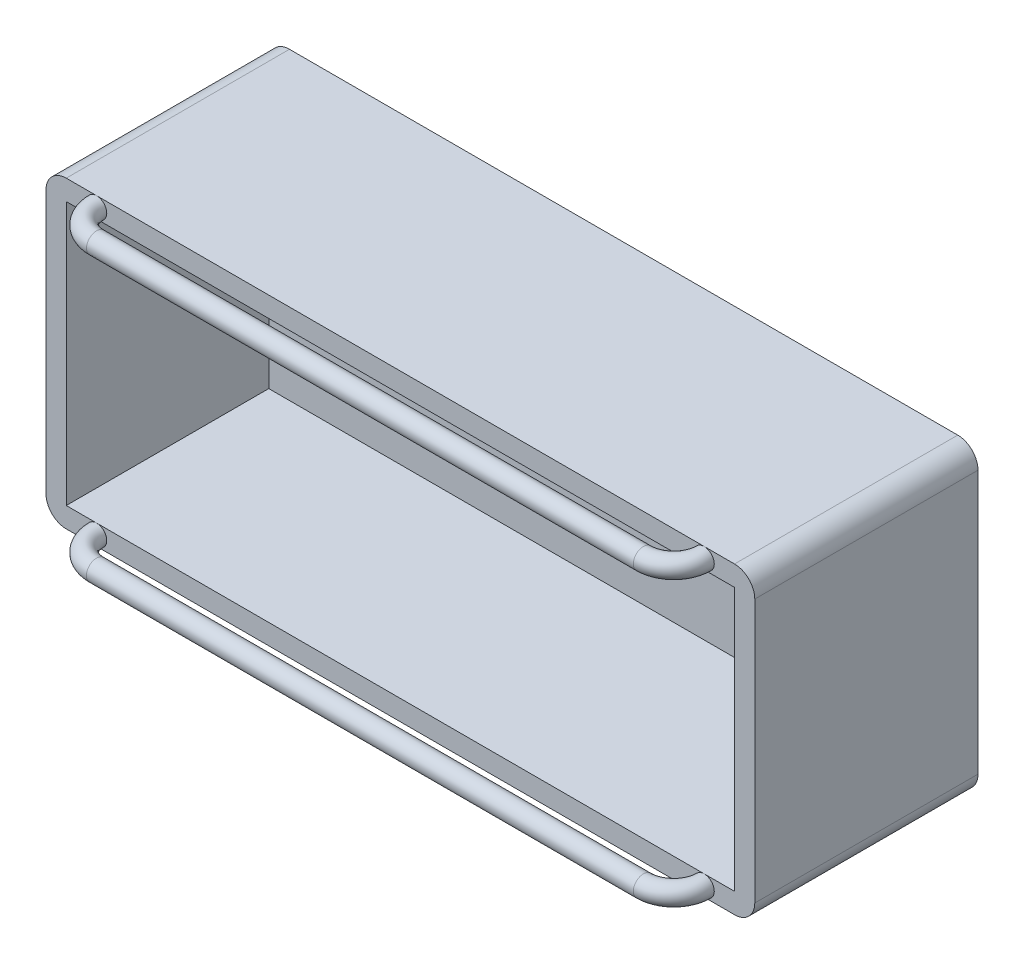
ISO-10303-21;
HEADER;
FILE_DESCRIPTION(('STEP AP214'),'2;1');
FILE_NAME('part.step','',(''),(''),'','','');
FILE_SCHEMA(('AUTOMOTIVE_DESIGN { 1 0 10303 214 1 1 1 1 }'));
ENDSEC;
DATA;
#1=APPLICATION_CONTEXT('core data for automotive mechanical design processes');
#2=APPLICATION_PROTOCOL_DEFINITION('international standard','automotive_design',2000,#1);
#3=PRODUCT_CONTEXT('',#1,'mechanical');
#4=PRODUCT('Part','Part','',(#3));
#5=PRODUCT_RELATED_PRODUCT_CATEGORY('part','',(#4));
#6=PRODUCT_DEFINITION_FORMATION('','',#4);
#7=PRODUCT_DEFINITION_CONTEXT('part definition',#1,'design');
#8=PRODUCT_DEFINITION('design','',#6,#7);
#9=PRODUCT_DEFINITION_SHAPE('','',#8);
#10=(LENGTH_UNIT() NAMED_UNIT(*) SI_UNIT(.MILLI.,.METRE.));
#11=(NAMED_UNIT(*) PLANE_ANGLE_UNIT() SI_UNIT($,.RADIAN.));
#12=(NAMED_UNIT(*) SI_UNIT($,.STERADIAN.) SOLID_ANGLE_UNIT());
#13=UNCERTAINTY_MEASURE_WITH_UNIT(LENGTH_MEASURE(1.E-05),#10,'distance_accuracy_value','');
#14=(GEOMETRIC_REPRESENTATION_CONTEXT(3) GLOBAL_UNCERTAINTY_ASSIGNED_CONTEXT((#13)) GLOBAL_UNIT_ASSIGNED_CONTEXT((#10,
#11,#12)) REPRESENTATION_CONTEXT('',''));
#15=CARTESIAN_POINT('',(0.,0.,0.));
#16=DIRECTION('',(0.,0.,1.));
#17=DIRECTION('',(1.,0.,0.));
#18=AXIS2_PLACEMENT_3D('',#15,#16,#17);
#19=CARTESIAN_POINT('',(0.,0.,22.0456351873431));
#20=DIRECTION('',(0.,0.,-1.));
#21=DIRECTION('',(-1.,0.,0.));
#22=AXIS2_PLACEMENT_3D('',#19,#20,#21);
#23=PLANE('',#22);
#24=CARTESIAN_POINT('',(5.,29.,22.0456351873431));
#25=DIRECTION('',(-2.60208521398066E-12,0.,1.));
#26=DIRECTION('',(1.,0.,2.60208521398066E-12));
#27=AXIS2_PLACEMENT_3D('',#24,#25,#26);
#28=CIRCLE('',#27,1.);
#29=CARTESIAN_POINT('',(5.,30.,22.0456351873431));
#30=VERTEX_POINT('',#29);
#31=CARTESIAN_POINT('',(5.,28.,22.0456351873431));
#32=VERTEX_POINT('',#31);
#33=EDGE_CURVE('E409',#30,#32,#28,.T.);
#34=ORIENTED_EDGE('',*,*,#33,.F.);
#35=DIRECTION('',(-1.,0.,0.));
#36=VECTOR('',#35,1.);
#37=CARTESIAN_POINT('',(0.,30.,22.0456351873431));
#38=LINE('',#37,#36);
#39=CARTESIAN_POINT('',(2.,30.,22.0456351873431));
#40=VERTEX_POINT('',#39);
#41=EDGE_CURVE('E483',#30,#40,#38,.T.);
#42=ORIENTED_EDGE('',*,*,#41,.T.);
#43=CARTESIAN_POINT('',(2.,28.,22.0456351873431));
#44=DIRECTION('',(0.,0.,-1.));
#45=DIRECTION('',(-1.,0.,0.));
#46=AXIS2_PLACEMENT_3D('',#43,#44,#45);
#47=CIRCLE('',#46,2.);
#48=CARTESIAN_POINT('',(0.,28.,22.0456351873431));
#49=VERTEX_POINT('',#48);
#50=EDGE_CURVE('E553',#40,#49,#47,.F.);
#51=ORIENTED_EDGE('',*,*,#50,.T.);
#52=DIRECTION('',(0.,-1.,0.));
#53=VECTOR('',#52,1.);
#54=CARTESIAN_POINT('',(0.,0.,22.0456351873431));
#55=LINE('',#54,#53);
#56=CARTESIAN_POINT('',(0.,2.,22.0456351873431));
#57=VERTEX_POINT('',#56);
#58=EDGE_CURVE('E470',#49,#57,#55,.T.);
#59=ORIENTED_EDGE('',*,*,#58,.T.);
#60=CARTESIAN_POINT('',(2.,2.,22.0456351873431));
#61=DIRECTION('',(0.,0.,-1.));
#62=DIRECTION('',(-1.,0.,0.));
#63=AXIS2_PLACEMENT_3D('',#60,#61,#62);
#64=CIRCLE('',#63,2.);
#65=CARTESIAN_POINT('',(2.,0.,22.0456351873431));
#66=VERTEX_POINT('',#65);
#67=EDGE_CURVE('E539',#57,#66,#64,.F.);
#68=ORIENTED_EDGE('',*,*,#67,.T.);
#69=DIRECTION('',(1.,0.,0.));
#70=VECTOR('',#69,1.);
#71=CARTESIAN_POINT('',(0.,0.,22.0456351873431));
#72=LINE('',#71,#70);
#73=CARTESIAN_POINT('',(5.,0.,22.0456351873431));
#74=VERTEX_POINT('',#73);
#75=EDGE_CURVE('E472',#66,#74,#72,.T.);
#76=ORIENTED_EDGE('',*,*,#75,.T.);
#77=CARTESIAN_POINT('',(5.,0.999999999999999,22.0456351873431));
#78=DIRECTION('',(0.,0.,-1.));
#79=DIRECTION('',(-1.,0.,0.));
#80=AXIS2_PLACEMENT_3D('',#77,#78,#79);
#81=CIRCLE('',#80,1.);
#82=CARTESIAN_POINT('',(5.,2.,22.0456351873431));
#83=VERTEX_POINT('',#82);
#84=EDGE_CURVE('E73',#74,#83,#81,.T.);
#85=ORIENTED_EDGE('',*,*,#84,.T.);
#86=DIRECTION('',(1.,0.,0.));
#87=VECTOR('',#86,1.);
#88=CARTESIAN_POINT('',(2.,2.,22.0456351873431));
#89=LINE('',#88,#87);
#90=CARTESIAN_POINT('',(2.,2.,22.0456351873431));
#91=VERTEX_POINT('',#90);
#92=EDGE_CURVE('E288',#91,#83,#89,.T.);
#93=ORIENTED_EDGE('',*,*,#92,.F.);
#94=DIRECTION('',(0.,-1.,0.));
#95=VECTOR('',#94,1.);
#96=CARTESIAN_POINT('',(2.,28.,22.0456351873431));
#97=LINE('',#96,#95);
#98=CARTESIAN_POINT('',(2.,28.,22.0456351873431));
#99=VERTEX_POINT('',#98);
#100=EDGE_CURVE('E256',#99,#91,#97,.T.);
#101=ORIENTED_EDGE('',*,*,#100,.F.);
#102=DIRECTION('',(-1.,0.,0.));
#103=VECTOR('',#102,1.);
#104=CARTESIAN_POINT('',(2.,28.,22.0456351873431));
#105=LINE('',#104,#103);
#106=EDGE_CURVE('E249',#32,#99,#105,.T.);
#107=ORIENTED_EDGE('',*,*,#106,.F.);
#108=EDGE_LOOP('',(#34,#42,#51,#59,#68,#76,#85,#93,#101,#107));
#109=FACE_BOUND('',#108,.T.);
#110=ADVANCED_FACE('F63',(#109),#23,.F.);
#111=EDGE_CURVE('E89',#32,#30,#28,.T.);
#112=ORIENTED_EDGE('',*,*,#111,.F.);
#113=CARTESIAN_POINT('',(65.,28.,22.0456351873431));
#114=VERTEX_POINT('',#113);
#115=EDGE_CURVE('E244',#114,#32,#105,.T.);
#116=ORIENTED_EDGE('',*,*,#115,.F.);
#117=CARTESIAN_POINT('',(65.,29.,22.0456351873431));
#118=DIRECTION('',(1.73472347599012E-12,0.,-1.));
#119=DIRECTION('',(-1.,0.,-1.73472347599012E-12));
#120=AXIS2_PLACEMENT_3D('',#117,#118,#119);
#121=CIRCLE('',#120,1.);
#122=CARTESIAN_POINT('',(65.,30.,22.0456351873431));
#123=VERTEX_POINT('',#122);
#124=EDGE_CURVE('E226',#114,#123,#121,.T.);
#125=ORIENTED_EDGE('',*,*,#124,.T.);
#126=EDGE_CURVE('E486',#123,#30,#38,.T.);
#127=ORIENTED_EDGE('',*,*,#126,.T.);
#128=EDGE_LOOP('',(#112,#116,#125,#127));
#129=FACE_BOUND('',#128,.T.);
#130=ADVANCED_FACE('F245',(#129),#23,.F.);
#131=CARTESIAN_POINT('',(68.,30.,22.0456351873431));
#132=VERTEX_POINT('',#131);
#133=EDGE_CURVE('E241',#132,#123,#38,.T.);
#134=ORIENTED_EDGE('',*,*,#133,.T.);
#135=EDGE_CURVE('E81',#123,#114,#121,.T.);
#136=ORIENTED_EDGE('',*,*,#135,.T.);
#137=CARTESIAN_POINT('',(68.,28.,22.0456351873431));
#138=VERTEX_POINT('',#137);
#139=EDGE_CURVE('E239',#138,#114,#105,.T.);
#140=ORIENTED_EDGE('',*,*,#139,.F.);
#141=DIRECTION('',(0.,1.,0.));
#142=VECTOR('',#141,1.);
#143=CARTESIAN_POINT('',(68.,28.,22.0456351873431));
#144=LINE('',#143,#142);
#145=CARTESIAN_POINT('',(68.,2.,22.0456351873431));
#146=VERTEX_POINT('',#145);
#147=EDGE_CURVE('E263',#146,#138,#144,.T.);
#148=ORIENTED_EDGE('',*,*,#147,.F.);
#149=CARTESIAN_POINT('',(65.,2.,22.0456351873431));
#150=VERTEX_POINT('',#149);
#151=EDGE_CURVE('E259',#150,#146,#89,.T.);
#152=ORIENTED_EDGE('',*,*,#151,.F.);
#153=CARTESIAN_POINT('',(65.,0.999999999999999,22.0456351873431));
#154=DIRECTION('',(0.,0.,1.));
#155=DIRECTION('',(1.,0.,0.));
#156=AXIS2_PLACEMENT_3D('',#153,#154,#155);
#157=CIRCLE('',#156,1.);
#158=CARTESIAN_POINT('',(65.,0.,22.0456351873431));
#159=VERTEX_POINT('',#158);
#160=EDGE_CURVE('E12',#159,#150,#157,.T.);
#161=ORIENTED_EDGE('',*,*,#160,.F.);
#162=CARTESIAN_POINT('',(68.,0.,22.0456351873431));
#163=VERTEX_POINT('',#162);
#164=EDGE_CURVE('E460',#159,#163,#72,.T.);
#165=ORIENTED_EDGE('',*,*,#164,.T.);
#166=CARTESIAN_POINT('',(68.,2.,22.0456351873431));
#167=DIRECTION('',(0.,0.,-1.));
#168=DIRECTION('',(-1.,0.,0.));
#169=AXIS2_PLACEMENT_3D('',#166,#167,#168);
#170=CIRCLE('',#169,2.);
#171=CARTESIAN_POINT('',(70.,2.,22.0456351873431));
#172=VERTEX_POINT('',#171);
#173=EDGE_CURVE('E514',#163,#172,#170,.F.);
#174=ORIENTED_EDGE('',*,*,#173,.T.);
#175=DIRECTION('',(0.,1.,0.));
#176=VECTOR('',#175,1.);
#177=CARTESIAN_POINT('',(70.,0.,22.0456351873431));
#178=LINE('',#177,#176);
#179=CARTESIAN_POINT('',(70.,28.,22.0456351873431));
#180=VERTEX_POINT('',#179);
#181=EDGE_CURVE('E479',#172,#180,#178,.T.);
#182=ORIENTED_EDGE('',*,*,#181,.T.);
#183=CARTESIAN_POINT('',(68.,28.,22.0456351873431));
#184=DIRECTION('',(0.,0.,-1.));
#185=DIRECTION('',(-1.,0.,0.));
#186=AXIS2_PLACEMENT_3D('',#183,#184,#185);
#187=CIRCLE('',#186,2.);
#188=EDGE_CURVE('E528',#180,#132,#187,.F.);
#189=ORIENTED_EDGE('',*,*,#188,.T.);
#190=EDGE_LOOP('',(#134,#136,#140,#148,#152,#161,#165,#174,#182,#189));
#191=FACE_BOUND('',#190,.T.);
#192=ADVANCED_FACE('F236',(#191),#23,.F.);
#193=EDGE_CURVE('E75',#150,#159,#157,.T.);
#194=ORIENTED_EDGE('',*,*,#193,.F.);
#195=EDGE_CURVE('E452',#83,#150,#89,.T.);
#196=ORIENTED_EDGE('',*,*,#195,.F.);
#197=EDGE_CURVE('E346',#83,#74,#81,.T.);
#198=ORIENTED_EDGE('',*,*,#197,.T.);
#199=EDGE_CURVE('E455',#74,#159,#72,.T.);
#200=ORIENTED_EDGE('',*,*,#199,.T.);
#201=EDGE_LOOP('',(#194,#196,#198,#200));
#202=FACE_BOUND('',#201,.T.);
#203=ADVANCED_FACE('F435',(#202),#23,.F.);
#204=CARTESIAN_POINT('',(2.,28.,22.0456351873431));
#205=DIRECTION('',(0.,0.,-1.));
#206=DIRECTION('',(-1.,0.,0.));
#207=AXIS2_PLACEMENT_3D('',#204,#205,#206);
#208=CYLINDRICAL_SURFACE('',#207,2.);
#209=DIRECTION('',(0.,0.,-1.));
#210=VECTOR('',#209,1.);
#211=CARTESIAN_POINT('',(0.,28.,22.0456351873431));
#212=LINE('',#211,#210);
#213=CARTESIAN_POINT('',(0.,28.,0.));
#214=VERTEX_POINT('',#213);
#215=EDGE_CURVE('E546',#49,#214,#212,.T.);
#216=ORIENTED_EDGE('',*,*,#215,.F.);
#217=ORIENTED_EDGE('',*,*,#50,.F.);
#218=DIRECTION('',(0.,0.,-1.));
#219=VECTOR('',#218,1.);
#220=CARTESIAN_POINT('',(2.,30.,22.0456351873431));
#221=LINE('',#220,#219);
#222=CARTESIAN_POINT('',(2.,30.,0.));
#223=VERTEX_POINT('',#222);
#224=EDGE_CURVE('E550',#223,#40,#221,.F.);
#225=ORIENTED_EDGE('',*,*,#224,.F.);
#226=CARTESIAN_POINT('',(2.,28.,0.));
#227=DIRECTION('',(0.,0.,-1.));
#228=DIRECTION('',(-1.,0.,0.));
#229=AXIS2_PLACEMENT_3D('',#226,#227,#228);
#230=CIRCLE('',#229,2.);
#231=EDGE_CURVE('E67',#214,#223,#230,.T.);
#232=ORIENTED_EDGE('',*,*,#231,.F.);
#233=EDGE_LOOP('',(#216,#217,#225,#232));
#234=FACE_BOUND('',#233,.T.);
#235=ADVANCED_FACE('F65',(#234),#208,.T.);
#236=CARTESIAN_POINT('',(2.,2.,22.0456351873431));
#237=DIRECTION('',(0.,0.,-1.));
#238=DIRECTION('',(-1.,0.,0.));
#239=AXIS2_PLACEMENT_3D('',#236,#237,#238);
#240=CYLINDRICAL_SURFACE('',#239,2.);
#241=DIRECTION('',(0.,0.,-1.));
#242=VECTOR('',#241,1.);
#243=CARTESIAN_POINT('',(2.,0.,22.0456351873431));
#244=LINE('',#243,#242);
#245=CARTESIAN_POINT('',(2.,0.,0.));
#246=VERTEX_POINT('',#245);
#247=EDGE_CURVE('E531',#66,#246,#244,.T.);
#248=ORIENTED_EDGE('',*,*,#247,.F.);
#249=ORIENTED_EDGE('',*,*,#67,.F.);
#250=DIRECTION('',(0.,0.,-1.));
#251=VECTOR('',#250,1.);
#252=CARTESIAN_POINT('',(0.,2.,22.0456351873431));
#253=LINE('',#252,#251);
#254=CARTESIAN_POINT('',(0.,2.,0.));
#255=VERTEX_POINT('',#254);
#256=EDGE_CURVE('E535',#255,#57,#253,.F.);
#257=ORIENTED_EDGE('',*,*,#256,.F.);
#258=CARTESIAN_POINT('',(2.,2.,0.));
#259=DIRECTION('',(0.,0.,-1.));
#260=DIRECTION('',(-1.,0.,0.));
#261=AXIS2_PLACEMENT_3D('',#258,#259,#260);
#262=CIRCLE('',#261,2.);
#263=EDGE_CURVE('E542',#246,#255,#262,.T.);
#264=ORIENTED_EDGE('',*,*,#263,.F.);
#265=EDGE_LOOP('',(#248,#249,#257,#264));
#266=FACE_BOUND('',#265,.T.);
#267=ADVANCED_FACE('F447',(#266),#240,.T.);
#268=CARTESIAN_POINT('',(68.,28.,22.0456351873431));
#269=DIRECTION('',(0.,0.,1.));
#270=DIRECTION('',(1.,0.,0.));
#271=AXIS2_PLACEMENT_3D('',#268,#269,#270);
#272=CYLINDRICAL_SURFACE('',#271,2.);
#273=DIRECTION('',(0.,0.,1.));
#274=VECTOR('',#273,1.);
#275=CARTESIAN_POINT('',(70.,28.,22.0456351873431));
#276=LINE('',#275,#274);
#277=CARTESIAN_POINT('',(70.,28.,0.));
#278=VERTEX_POINT('',#277);
#279=EDGE_CURVE('E517',#278,#180,#276,.T.);
#280=ORIENTED_EDGE('',*,*,#279,.F.);
#281=CARTESIAN_POINT('',(68.,28.,0.));
#282=DIRECTION('',(0.,0.,-1.));
#283=DIRECTION('',(-1.,0.,0.));
#284=AXIS2_PLACEMENT_3D('',#281,#282,#283);
#285=CIRCLE('',#284,2.);
#286=CARTESIAN_POINT('',(68.,30.,0.));
#287=VERTEX_POINT('',#286);
#288=EDGE_CURVE('E525',#287,#278,#285,.T.);
#289=ORIENTED_EDGE('',*,*,#288,.F.);
#290=DIRECTION('',(0.,0.,1.));
#291=VECTOR('',#290,1.);
#292=CARTESIAN_POINT('',(68.,30.,22.0456351873431));
#293=LINE('',#292,#291);
#294=EDGE_CURVE('E521',#132,#287,#293,.F.);
#295=ORIENTED_EDGE('',*,*,#294,.F.);
#296=ORIENTED_EDGE('',*,*,#188,.F.);
#297=EDGE_LOOP('',(#280,#289,#295,#296));
#298=FACE_BOUND('',#297,.T.);
#299=ADVANCED_FACE('F694',(#298),#272,.T.);
#300=CARTESIAN_POINT('',(68.,2.,22.0456351873431));
#301=DIRECTION('',(0.,0.,1.));
#302=DIRECTION('',(1.,0.,0.));
#303=AXIS2_PLACEMENT_3D('',#300,#301,#302);
#304=CYLINDRICAL_SURFACE('',#303,2.);
#305=DIRECTION('',(0.,0.,1.));
#306=VECTOR('',#305,1.);
#307=CARTESIAN_POINT('',(68.,0.,22.0456351873431));
#308=LINE('',#307,#306);
#309=CARTESIAN_POINT('',(68.,0.,0.));
#310=VERTEX_POINT('',#309);
#311=EDGE_CURVE('E468',#310,#163,#308,.T.);
#312=ORIENTED_EDGE('',*,*,#311,.F.);
#313=CARTESIAN_POINT('',(68.,2.,0.));
#314=DIRECTION('',(0.,0.,-1.));
#315=DIRECTION('',(-1.,0.,0.));
#316=AXIS2_PLACEMENT_3D('',#313,#314,#315);
#317=CIRCLE('',#316,2.);
#318=CARTESIAN_POINT('',(70.,2.,0.));
#319=VERTEX_POINT('',#318);
#320=EDGE_CURVE('E510',#319,#310,#317,.T.);
#321=ORIENTED_EDGE('',*,*,#320,.F.);
#322=DIRECTION('',(0.,0.,1.));
#323=VECTOR('',#322,1.);
#324=CARTESIAN_POINT('',(70.,2.,22.0456351873431));
#325=LINE('',#324,#323);
#326=EDGE_CURVE('E506',#172,#319,#325,.F.);
#327=ORIENTED_EDGE('',*,*,#326,.F.);
#328=ORIENTED_EDGE('',*,*,#173,.F.);
#329=EDGE_LOOP('',(#312,#321,#327,#328));
#330=FACE_BOUND('',#329,.T.);
#331=ADVANCED_FACE('F703',(#330),#304,.T.);
#332=CARTESIAN_POINT('',(0.,0.,0.));
#333=DIRECTION('',(0.,0.,-1.));
#334=DIRECTION('',(-1.,0.,0.));
#335=AXIS2_PLACEMENT_3D('',#332,#333,#334);
#336=PLANE('',#335);
#337=CARTESIAN_POINT('',(10.,15.,0.));
#338=DIRECTION('',(0.,0.,-1.));
#339=DIRECTION('',(-1.,0.,0.));
#340=AXIS2_PLACEMENT_3D('',#337,#338,#339);
#341=CIRCLE('',#340,2.00000000000001);
#342=CARTESIAN_POINT('',(10.,13.,0.));
#343=VERTEX_POINT('',#342);
#344=CARTESIAN_POINT('',(10.,17.,0.));
#345=VERTEX_POINT('',#344);
#346=EDGE_CURVE('E266',#343,#345,#341,.T.);
#347=ORIENTED_EDGE('',*,*,#346,.F.);
#348=DIRECTION('',(-1.,0.,0.));
#349=VECTOR('',#348,1.);
#350=CARTESIAN_POINT('',(0.,13.,0.));
#351=LINE('',#350,#349);
#352=CARTESIAN_POINT('',(24.,13.,0.));
#353=VERTEX_POINT('',#352);
#354=EDGE_CURVE('E297',#353,#343,#351,.T.);
#355=ORIENTED_EDGE('',*,*,#354,.F.);
#356=CARTESIAN_POINT('',(24.,15.,0.));
#357=DIRECTION('',(0.,0.,-1.));
#358=DIRECTION('',(-1.,0.,0.));
#359=AXIS2_PLACEMENT_3D('',#356,#357,#358);
#360=CIRCLE('',#359,2.00000000000001);
#361=CARTESIAN_POINT('',(24.,17.,0.));
#362=VERTEX_POINT('',#361);
#363=EDGE_CURVE('E293',#362,#353,#360,.T.);
#364=ORIENTED_EDGE('',*,*,#363,.F.);
#365=DIRECTION('',(-1.,0.,0.));
#366=VECTOR('',#365,1.);
#367=CARTESIAN_POINT('',(0.,17.,0.));
#368=LINE('',#367,#366);
#369=EDGE_CURVE('E270',#362,#345,#368,.T.);
#370=ORIENTED_EDGE('',*,*,#369,.T.);
#371=EDGE_LOOP('',(#347,#355,#364,#370));
#372=FACE_BOUND('',#371,.T.);
#373=DIRECTION('',(0.,-1.,0.));
#374=VECTOR('',#373,1.);
#375=CARTESIAN_POINT('',(0.,0.,0.));
#376=LINE('',#375,#374);
#377=EDGE_CURVE('E490',#214,#255,#376,.T.);
#378=ORIENTED_EDGE('',*,*,#377,.F.);
#379=ORIENTED_EDGE('',*,*,#231,.T.);
#380=DIRECTION('',(-1.,0.,0.));
#381=VECTOR('',#380,1.);
#382=CARTESIAN_POINT('',(0.,30.,0.));
#383=LINE('',#382,#381);
#384=EDGE_CURVE('E475',#287,#223,#383,.T.);
#385=ORIENTED_EDGE('',*,*,#384,.F.);
#386=ORIENTED_EDGE('',*,*,#288,.T.);
#387=DIRECTION('',(0.,1.,0.));
#388=VECTOR('',#387,1.);
#389=CARTESIAN_POINT('',(70.,0.,0.));
#390=LINE('',#389,#388);
#391=EDGE_CURVE('E497',#319,#278,#390,.T.);
#392=ORIENTED_EDGE('',*,*,#391,.F.);
#393=ORIENTED_EDGE('',*,*,#320,.T.);
#394=DIRECTION('',(1.,0.,0.));
#395=VECTOR('',#394,1.);
#396=CARTESIAN_POINT('',(0.,0.,0.));
#397=LINE('',#396,#395);
#398=EDGE_CURVE('E493',#246,#310,#397,.T.);
#399=ORIENTED_EDGE('',*,*,#398,.F.);
#400=ORIENTED_EDGE('',*,*,#263,.T.);
#401=EDGE_LOOP('',(#378,#379,#385,#386,#392,#393,#399,#400));
#402=FACE_BOUND('',#401,.T.);
#403=DIRECTION('',(1.,0.,0.));
#404=VECTOR('',#403,1.);
#405=CARTESIAN_POINT('',(0.,13.,0.));
#406=LINE('',#405,#404);
#407=CARTESIAN_POINT('',(46.,13.,0.));
#408=VERTEX_POINT('',#407);
#409=CARTESIAN_POINT('',(60.,13.,0.));
#410=VERTEX_POINT('',#409);
#411=EDGE_CURVE('E304',#408,#410,#406,.T.);
#412=ORIENTED_EDGE('',*,*,#411,.T.);
#413=CARTESIAN_POINT('',(60.,15.,0.));
#414=DIRECTION('',(0.,0.,-1.));
#415=DIRECTION('',(-1.,0.,0.));
#416=AXIS2_PLACEMENT_3D('',#413,#414,#415);
#417=CIRCLE('',#416,2.);
#418=CARTESIAN_POINT('',(60.,17.,0.));
#419=VERTEX_POINT('',#418);
#420=EDGE_CURVE('E300',#410,#419,#417,.F.);
#421=ORIENTED_EDGE('',*,*,#420,.T.);
#422=DIRECTION('',(1.,0.,0.));
#423=VECTOR('',#422,1.);
#424=CARTESIAN_POINT('',(0.,17.,0.));
#425=LINE('',#424,#423);
#426=CARTESIAN_POINT('',(46.,17.,0.));
#427=VERTEX_POINT('',#426);
#428=EDGE_CURVE('E312',#427,#419,#425,.T.);
#429=ORIENTED_EDGE('',*,*,#428,.F.);
#430=CARTESIAN_POINT('',(46.,15.,0.));
#431=DIRECTION('',(0.,0.,-1.));
#432=DIRECTION('',(-1.,0.,0.));
#433=AXIS2_PLACEMENT_3D('',#430,#431,#432);
#434=CIRCLE('',#433,2.);
#435=EDGE_CURVE('E308',#427,#408,#434,.F.);
#436=ORIENTED_EDGE('',*,*,#435,.T.);
#437=EDGE_LOOP('',(#412,#421,#429,#436));
#438=FACE_BOUND('',#437,.T.);
#439=ADVANCED_FACE('F712',(#372,#402,#438),#336,.T.);
#440=CARTESIAN_POINT('',(0.,0.,2.04563518734308));
#441=DIRECTION('',(0.,0.,1.));
#442=DIRECTION('',(1.,0.,0.));
#443=AXIS2_PLACEMENT_3D('',#440,#441,#442);
#444=PLANE('',#443);
#445=CARTESIAN_POINT('',(10.,15.,2.04563518734308));
#446=DIRECTION('',(0.,0.,1.));
#447=DIRECTION('',(1.,0.,0.));
#448=AXIS2_PLACEMENT_3D('',#445,#446,#447);
#449=CIRCLE('',#448,2.00000000000001);
#450=CARTESIAN_POINT('',(10.,17.,2.04563518734308));
#451=VERTEX_POINT('',#450);
#452=CARTESIAN_POINT('',(10.,13.,2.04563518734308));
#453=VERTEX_POINT('',#452);
#454=EDGE_CURVE('E320',#451,#453,#449,.T.);
#455=ORIENTED_EDGE('',*,*,#454,.F.);
#456=DIRECTION('',(1.,0.,0.));
#457=VECTOR('',#456,1.);
#458=CARTESIAN_POINT('',(10.,17.,2.04563518734308));
#459=LINE('',#458,#457);
#460=CARTESIAN_POINT('',(24.,17.,2.04563518734308));
#461=VERTEX_POINT('',#460);
#462=EDGE_CURVE('E352',#451,#461,#459,.T.);
#463=ORIENTED_EDGE('',*,*,#462,.T.);
#464=CARTESIAN_POINT('',(24.,15.,2.04563518734308));
#465=DIRECTION('',(0.,0.,1.));
#466=DIRECTION('',(1.,0.,0.));
#467=AXIS2_PLACEMENT_3D('',#464,#465,#466);
#468=CIRCLE('',#467,2.00000000000001);
#469=CARTESIAN_POINT('',(24.,13.,2.04563518734308));
#470=VERTEX_POINT('',#469);
#471=EDGE_CURVE('E363',#470,#461,#468,.T.);
#472=ORIENTED_EDGE('',*,*,#471,.F.);
#473=DIRECTION('',(1.,0.,0.));
#474=VECTOR('',#473,1.);
#475=CARTESIAN_POINT('',(10.,13.,2.04563518734308));
#476=LINE('',#475,#474);
#477=EDGE_CURVE('E367',#453,#470,#476,.T.);
#478=ORIENTED_EDGE('',*,*,#477,.F.);
#479=EDGE_LOOP('',(#455,#463,#472,#478));
#480=FACE_BOUND('',#479,.T.);
#481=DIRECTION('',(0.,1.,0.));
#482=VECTOR('',#481,1.);
#483=CARTESIAN_POINT('',(68.,28.,2.04563518734308));
#484=LINE('',#483,#482);
#485=CARTESIAN_POINT('',(68.,2.,2.04563518734308));
#486=VERTEX_POINT('',#485);
#487=CARTESIAN_POINT('',(68.,28.,2.04563518734308));
#488=VERTEX_POINT('',#487);
#489=EDGE_CURVE('E285',#486,#488,#484,.T.);
#490=ORIENTED_EDGE('',*,*,#489,.T.);
#491=DIRECTION('',(-1.,0.,0.));
#492=VECTOR('',#491,1.);
#493=CARTESIAN_POINT('',(2.,28.,2.04563518734308));
#494=LINE('',#493,#492);
#495=CARTESIAN_POINT('',(2.,28.,2.04563518734308));
#496=VERTEX_POINT('',#495);
#497=EDGE_CURVE('E281',#488,#496,#494,.T.);
#498=ORIENTED_EDGE('',*,*,#497,.T.);
#499=DIRECTION('',(0.,-1.,0.));
#500=VECTOR('',#499,1.);
#501=CARTESIAN_POINT('',(2.,28.,2.04563518734308));
#502=LINE('',#501,#500);
#503=CARTESIAN_POINT('',(2.,2.,2.04563518734308));
#504=VERTEX_POINT('',#503);
#505=EDGE_CURVE('E277',#496,#504,#502,.T.);
#506=ORIENTED_EDGE('',*,*,#505,.T.);
#507=DIRECTION('',(1.,0.,0.));
#508=VECTOR('',#507,1.);
#509=CARTESIAN_POINT('',(2.,2.,2.04563518734308));
#510=LINE('',#509,#508);
#511=EDGE_CURVE('E273',#504,#486,#510,.T.);
#512=ORIENTED_EDGE('',*,*,#511,.T.);
#513=EDGE_LOOP('',(#490,#498,#506,#512));
#514=FACE_BOUND('',#513,.T.);
#515=DIRECTION('',(-1.,0.,0.));
#516=VECTOR('',#515,1.);
#517=CARTESIAN_POINT('',(60.,17.,2.04563518734308));
#518=LINE('',#517,#516);
#519=CARTESIAN_POINT('',(60.,17.,2.04563518734308));
#520=VERTEX_POINT('',#519);
#521=CARTESIAN_POINT('',(46.,17.,2.04563518734308));
#522=VERTEX_POINT('',#521);
#523=EDGE_CURVE('E329',#520,#522,#518,.T.);
#524=ORIENTED_EDGE('',*,*,#523,.F.);
#525=CARTESIAN_POINT('',(60.,15.,2.04563518734308));
#526=DIRECTION('',(0.,0.,-1.));
#527=DIRECTION('',(-1.,0.,0.));
#528=AXIS2_PLACEMENT_3D('',#525,#526,#527);
#529=CIRCLE('',#528,2.);
#530=CARTESIAN_POINT('',(60.,13.,2.04563518734308));
#531=VERTEX_POINT('',#530);
#532=EDGE_CURVE('E316',#520,#531,#529,.T.);
#533=ORIENTED_EDGE('',*,*,#532,.T.);
#534=DIRECTION('',(-1.,0.,0.));
#535=VECTOR('',#534,1.);
#536=CARTESIAN_POINT('',(60.,13.,2.04563518734308));
#537=LINE('',#536,#535);
#538=CARTESIAN_POINT('',(46.,13.,2.04563518734308));
#539=VERTEX_POINT('',#538);
#540=EDGE_CURVE('E321',#531,#539,#537,.T.);
#541=ORIENTED_EDGE('',*,*,#540,.T.);
#542=CARTESIAN_POINT('',(46.,15.,2.04563518734308));
#543=DIRECTION('',(0.,0.,-1.));
#544=DIRECTION('',(-1.,0.,0.));
#545=AXIS2_PLACEMENT_3D('',#542,#543,#544);
#546=CIRCLE('',#545,2.);
#547=EDGE_CURVE('E325',#539,#522,#546,.T.);
#548=ORIENTED_EDGE('',*,*,#547,.T.);
#549=EDGE_LOOP('',(#524,#533,#541,#548));
#550=FACE_BOUND('',#549,.T.);
#551=ADVANCED_FACE('F788',(#480,#514,#550),#444,.T.);
#552=CARTESIAN_POINT('',(0.,0.,22.0456351873431));
#553=DIRECTION('',(1.,0.,0.));
#554=DIRECTION('',(0.,0.,-1.));
#555=AXIS2_PLACEMENT_3D('',#552,#553,#554);
#556=PLANE('',#555);
#557=ORIENTED_EDGE('',*,*,#58,.F.);
#558=ORIENTED_EDGE('',*,*,#215,.T.);
#559=ORIENTED_EDGE('',*,*,#377,.T.);
#560=ORIENTED_EDGE('',*,*,#256,.T.);
#561=EDGE_LOOP('',(#557,#558,#559,#560));
#562=FACE_BOUND('',#561,.T.);
#563=ADVANCED_FACE('F795',(#562),#556,.F.);
#564=CARTESIAN_POINT('',(0.,0.,22.0456351873431));
#565=DIRECTION('',(0.,1.,0.));
#566=DIRECTION('',(0.,0.,1.));
#567=AXIS2_PLACEMENT_3D('',#564,#565,#566);
#568=PLANE('',#567);
#569=ORIENTED_EDGE('',*,*,#75,.F.);
#570=ORIENTED_EDGE('',*,*,#247,.T.);
#571=ORIENTED_EDGE('',*,*,#398,.T.);
#572=ORIENTED_EDGE('',*,*,#311,.T.);
#573=ORIENTED_EDGE('',*,*,#164,.F.);
#574=ORIENTED_EDGE('',*,*,#199,.F.);
#575=EDGE_LOOP('',(#569,#570,#571,#572,#573,#574));
#576=FACE_BOUND('',#575,.T.);
#577=ADVANCED_FACE('F465',(#576),#568,.F.);
#578=CARTESIAN_POINT('',(70.,0.,22.0456351873431));
#579=DIRECTION('',(-1.,0.,0.));
#580=DIRECTION('',(0.,0.,1.));
#581=AXIS2_PLACEMENT_3D('',#578,#579,#580);
#582=PLANE('',#581);
#583=ORIENTED_EDGE('',*,*,#391,.T.);
#584=ORIENTED_EDGE('',*,*,#279,.T.);
#585=ORIENTED_EDGE('',*,*,#181,.F.);
#586=ORIENTED_EDGE('',*,*,#326,.T.);
#587=EDGE_LOOP('',(#583,#584,#585,#586));
#588=FACE_BOUND('',#587,.T.);
#589=ADVANCED_FACE('F834',(#588),#582,.F.);
#590=CARTESIAN_POINT('',(0.,30.,22.0456351873431));
#591=DIRECTION('',(0.,-1.,0.));
#592=DIRECTION('',(0.,0.,-1.));
#593=AXIS2_PLACEMENT_3D('',#590,#591,#592);
#594=PLANE('',#593);
#595=ORIENTED_EDGE('',*,*,#384,.T.);
#596=ORIENTED_EDGE('',*,*,#224,.T.);
#597=ORIENTED_EDGE('',*,*,#41,.F.);
#598=ORIENTED_EDGE('',*,*,#126,.F.);
#599=ORIENTED_EDGE('',*,*,#133,.F.);
#600=ORIENTED_EDGE('',*,*,#294,.T.);
#601=EDGE_LOOP('',(#595,#596,#597,#598,#599,#600));
#602=FACE_BOUND('',#601,.T.);
#603=ADVANCED_FACE('F828',(#602),#594,.F.);
#604=CARTESIAN_POINT('',(68.,28.,2.04563518734308));
#605=DIRECTION('',(1.,0.,0.));
#606=DIRECTION('',(0.,0.,-1.));
#607=AXIS2_PLACEMENT_3D('',#604,#605,#606);
#608=PLANE('',#607);
#609=ORIENTED_EDGE('',*,*,#147,.T.);
#610=DIRECTION('',(0.,0.,1.));
#611=VECTOR('',#610,1.);
#612=CARTESIAN_POINT('',(68.,28.,2.04563518734308));
#613=LINE('',#612,#611);
#614=EDGE_CURVE('E254',#488,#138,#613,.T.);
#615=ORIENTED_EDGE('',*,*,#614,.F.);
#616=ORIENTED_EDGE('',*,*,#489,.F.);
#617=DIRECTION('',(0.,0.,1.));
#618=VECTOR('',#617,1.);
#619=CARTESIAN_POINT('',(68.,2.,2.04563518734308));
#620=LINE('',#619,#618);
#621=EDGE_CURVE('E494',#486,#146,#620,.T.);
#622=ORIENTED_EDGE('',*,*,#621,.T.);
#623=EDGE_LOOP('',(#609,#615,#616,#622));
#624=FACE_BOUND('',#623,.T.);
#625=ADVANCED_FACE('F820',(#624),#608,.F.);
#626=CARTESIAN_POINT('',(2.,2.,2.04563518734308));
#627=DIRECTION('',(0.,-1.,0.));
#628=DIRECTION('',(0.,0.,-1.));
#629=AXIS2_PLACEMENT_3D('',#626,#627,#628);
#630=PLANE('',#629);
#631=ORIENTED_EDGE('',*,*,#92,.T.);
#632=ORIENTED_EDGE('',*,*,#195,.T.);
#633=ORIENTED_EDGE('',*,*,#151,.T.);
#634=ORIENTED_EDGE('',*,*,#621,.F.);
#635=ORIENTED_EDGE('',*,*,#511,.F.);
#636=DIRECTION('',(0.,0.,1.));
#637=VECTOR('',#636,1.);
#638=CARTESIAN_POINT('',(2.,2.,2.04563518734308));
#639=LINE('',#638,#637);
#640=EDGE_CURVE('E892',#504,#91,#639,.T.);
#641=ORIENTED_EDGE('',*,*,#640,.T.);
#642=EDGE_LOOP('',(#631,#632,#633,#634,#635,#641));
#643=FACE_BOUND('',#642,.T.);
#644=ADVANCED_FACE('F811',(#643),#630,.F.);
#645=CARTESIAN_POINT('',(2.,28.,2.04563518734308));
#646=DIRECTION('',(-1.,0.,0.));
#647=DIRECTION('',(0.,-1.,0.));
#648=AXIS2_PLACEMENT_3D('',#645,#646,#647);
#649=PLANE('',#648);
#650=ORIENTED_EDGE('',*,*,#100,.T.);
#651=ORIENTED_EDGE('',*,*,#640,.F.);
#652=ORIENTED_EDGE('',*,*,#505,.F.);
#653=DIRECTION('',(0.,0.,1.));
#654=VECTOR('',#653,1.);
#655=CARTESIAN_POINT('',(2.,28.,2.04563518734308));
#656=LINE('',#655,#654);
#657=EDGE_CURVE('E893',#496,#99,#656,.T.);
#658=ORIENTED_EDGE('',*,*,#657,.T.);
#659=EDGE_LOOP('',(#650,#651,#652,#658));
#660=FACE_BOUND('',#659,.T.);
#661=ADVANCED_FACE('F804',(#660),#649,.F.);
#662=CARTESIAN_POINT('',(2.,28.,2.04563518734308));
#663=DIRECTION('',(0.,1.,0.));
#664=DIRECTION('',(0.,0.,1.));
#665=AXIS2_PLACEMENT_3D('',#662,#663,#664);
#666=PLANE('',#665);
#667=ORIENTED_EDGE('',*,*,#139,.T.);
#668=ORIENTED_EDGE('',*,*,#115,.T.);
#669=ORIENTED_EDGE('',*,*,#106,.T.);
#670=ORIENTED_EDGE('',*,*,#657,.F.);
#671=ORIENTED_EDGE('',*,*,#497,.F.);
#672=ORIENTED_EDGE('',*,*,#614,.T.);
#673=EDGE_LOOP('',(#667,#668,#669,#670,#671,#672));
#674=FACE_BOUND('',#673,.T.);
#675=ADVANCED_FACE('F252',(#674),#666,.F.);
#676=CARTESIAN_POINT('',(60.,15.,-17.9543648126569));
#677=DIRECTION('',(0.,0.,1.));
#678=DIRECTION('',(1.,0.,0.));
#679=AXIS2_PLACEMENT_3D('',#676,#677,#678);
#680=CYLINDRICAL_SURFACE('',#679,2.);
#681=DIRECTION('',(0.,0.,1.));
#682=VECTOR('',#681,1.);
#683=CARTESIAN_POINT('',(60.,13.,-17.9543648126569));
#684=LINE('',#683,#682);
#685=EDGE_CURVE('E343',#410,#531,#684,.T.);
#686=ORIENTED_EDGE('',*,*,#685,.T.);
#687=ORIENTED_EDGE('',*,*,#532,.F.);
#688=DIRECTION('',(0.,0.,1.));
#689=VECTOR('',#688,1.);
#690=CARTESIAN_POINT('',(60.,17.,-17.9543648126569));
#691=LINE('',#690,#689);
#692=EDGE_CURVE('E333',#419,#520,#691,.T.);
#693=ORIENTED_EDGE('',*,*,#692,.F.);
#694=ORIENTED_EDGE('',*,*,#420,.F.);
#695=EDGE_LOOP('',(#686,#687,#693,#694));
#696=FACE_BOUND('',#695,.T.);
#697=ADVANCED_FACE('F771',(#696),#680,.F.);
#698=CARTESIAN_POINT('',(60.,13.,-17.9543648126569));
#699=DIRECTION('',(0.,1.,0.));
#700=DIRECTION('',(0.,0.,1.));
#701=AXIS2_PLACEMENT_3D('',#698,#699,#700);
#702=PLANE('',#701);
#703=DIRECTION('',(0.,0.,1.));
#704=VECTOR('',#703,1.);
#705=CARTESIAN_POINT('',(46.,13.,-17.9543648126569));
#706=LINE('',#705,#704);
#707=EDGE_CURVE('E340',#408,#539,#706,.T.);
#708=ORIENTED_EDGE('',*,*,#707,.T.);
#709=ORIENTED_EDGE('',*,*,#540,.F.);
#710=ORIENTED_EDGE('',*,*,#685,.F.);
#711=ORIENTED_EDGE('',*,*,#411,.F.);
#712=EDGE_LOOP('',(#708,#709,#710,#711));
#713=FACE_BOUND('',#712,.T.);
#714=ADVANCED_FACE('F762',(#713),#702,.T.);
#715=CARTESIAN_POINT('',(46.,15.,-17.9543648126569));
#716=DIRECTION('',(0.,0.,1.));
#717=DIRECTION('',(1.,0.,0.));
#718=AXIS2_PLACEMENT_3D('',#715,#716,#717);
#719=CYLINDRICAL_SURFACE('',#718,2.);
#720=DIRECTION('',(0.,0.,1.));
#721=VECTOR('',#720,1.);
#722=CARTESIAN_POINT('',(46.,17.,-17.9543648126569));
#723=LINE('',#722,#721);
#724=EDGE_CURVE('E337',#427,#522,#723,.T.);
#725=ORIENTED_EDGE('',*,*,#724,.T.);
#726=ORIENTED_EDGE('',*,*,#547,.F.);
#727=ORIENTED_EDGE('',*,*,#707,.F.);
#728=ORIENTED_EDGE('',*,*,#435,.F.);
#729=EDGE_LOOP('',(#725,#726,#727,#728));
#730=FACE_BOUND('',#729,.T.);
#731=ADVANCED_FACE('F753',(#730),#719,.F.);
#732=CARTESIAN_POINT('',(60.,17.,-17.9543648126569));
#733=DIRECTION('',(0.,1.,0.));
#734=DIRECTION('',(0.,0.,1.));
#735=AXIS2_PLACEMENT_3D('',#732,#733,#734);
#736=PLANE('',#735);
#737=ORIENTED_EDGE('',*,*,#428,.T.);
#738=ORIENTED_EDGE('',*,*,#692,.T.);
#739=ORIENTED_EDGE('',*,*,#523,.T.);
#740=ORIENTED_EDGE('',*,*,#724,.F.);
#741=EDGE_LOOP('',(#737,#738,#739,#740));
#742=FACE_BOUND('',#741,.T.);
#743=ADVANCED_FACE('F744',(#742),#736,.F.);
#744=CARTESIAN_POINT('',(10.,15.,-17.9543648126569));
#745=DIRECTION('',(0.,0.,1.));
#746=DIRECTION('',(1.,0.,0.));
#747=AXIS2_PLACEMENT_3D('',#744,#745,#746);
#748=CYLINDRICAL_SURFACE('',#747,2.00000000000001);
#749=ORIENTED_EDGE('',*,*,#346,.T.);
#750=DIRECTION('',(0.,0.,1.));
#751=VECTOR('',#750,1.);
#752=CARTESIAN_POINT('',(10.,17.,-17.9543648126569));
#753=LINE('',#752,#751);
#754=EDGE_CURVE('E315',#345,#451,#753,.T.);
#755=ORIENTED_EDGE('',*,*,#754,.T.);
#756=ORIENTED_EDGE('',*,*,#454,.T.);
#757=DIRECTION('',(0.,0.,1.));
#758=VECTOR('',#757,1.);
#759=CARTESIAN_POINT('',(10.,13.,-17.9543648126569));
#760=LINE('',#759,#758);
#761=EDGE_CURVE('E347',#343,#453,#760,.T.);
#762=ORIENTED_EDGE('',*,*,#761,.F.);
#763=EDGE_LOOP('',(#749,#755,#756,#762));
#764=FACE_BOUND('',#763,.T.);
#765=ADVANCED_FACE('F735',(#764),#748,.F.);
#766=CARTESIAN_POINT('',(10.,17.,-17.9543648126569));
#767=DIRECTION('',(0.,-1.,0.));
#768=DIRECTION('',(0.,0.,-1.));
#769=AXIS2_PLACEMENT_3D('',#766,#767,#768);
#770=PLANE('',#769);
#771=DIRECTION('',(0.,0.,1.));
#772=VECTOR('',#771,1.);
#773=CARTESIAN_POINT('',(24.,17.,-17.9543648126569));
#774=LINE('',#773,#772);
#775=EDGE_CURVE('E355',#362,#461,#774,.T.);
#776=ORIENTED_EDGE('',*,*,#775,.T.);
#777=ORIENTED_EDGE('',*,*,#462,.F.);
#778=ORIENTED_EDGE('',*,*,#754,.F.);
#779=ORIENTED_EDGE('',*,*,#369,.F.);
#780=EDGE_LOOP('',(#776,#777,#778,#779));
#781=FACE_BOUND('',#780,.T.);
#782=ADVANCED_FACE('F726',(#781),#770,.T.);
#783=CARTESIAN_POINT('',(24.,15.,-17.9543648126569));
#784=DIRECTION('',(0.,0.,1.));
#785=DIRECTION('',(1.,0.,0.));
#786=AXIS2_PLACEMENT_3D('',#783,#784,#785);
#787=CYLINDRICAL_SURFACE('',#786,2.00000000000001);
#788=ORIENTED_EDGE('',*,*,#363,.T.);
#789=DIRECTION('',(0.,0.,1.));
#790=VECTOR('',#789,1.);
#791=CARTESIAN_POINT('',(24.,13.,-17.9543648126569));
#792=LINE('',#791,#790);
#793=EDGE_CURVE('E351',#353,#470,#792,.T.);
#794=ORIENTED_EDGE('',*,*,#793,.T.);
#795=ORIENTED_EDGE('',*,*,#471,.T.);
#796=ORIENTED_EDGE('',*,*,#775,.F.);
#797=EDGE_LOOP('',(#788,#794,#795,#796));
#798=FACE_BOUND('',#797,.T.);
#799=ADVANCED_FACE('F590',(#798),#787,.F.);
#800=CARTESIAN_POINT('',(10.,13.,-17.9543648126569));
#801=DIRECTION('',(0.,-1.,0.));
#802=DIRECTION('',(0.,0.,-1.));
#803=AXIS2_PLACEMENT_3D('',#800,#801,#802);
#804=PLANE('',#803);
#805=ORIENTED_EDGE('',*,*,#354,.T.);
#806=ORIENTED_EDGE('',*,*,#761,.T.);
#807=ORIENTED_EDGE('',*,*,#477,.T.);
#808=ORIENTED_EDGE('',*,*,#793,.F.);
#809=EDGE_LOOP('',(#805,#806,#807,#808));
#810=FACE_BOUND('',#809,.T.);
#811=ADVANCED_FACE('F430',(#810),#804,.F.);
#812=CARTESIAN_POINT('',(65.,0.999999999999999,22.0456351873431));
#813=DIRECTION('',(0.,0.,1.));
#814=DIRECTION('',(1.,0.,0.));
#815=AXIS2_PLACEMENT_3D('',#812,#813,#814);
#816=CYLINDRICAL_SURFACE('',#815,1.);
#817=CARTESIAN_POINT('',(65.,0.999999999999999,22.0466351873431));
#818=DIRECTION('',(0.,0.,1.));
#819=DIRECTION('',(1.,0.,0.));
#820=AXIS2_PLACEMENT_3D('',#817,#818,#819);
#821=CIRCLE('',#820,1.);
#822=CARTESIAN_POINT('',(66.,0.999999999999999,22.0466351873431));
#823=VERTEX_POINT('',#822);
#824=EDGE_CURVE('E388',#823,#823,#821,.T.);
#825=ORIENTED_EDGE('',*,*,#824,.F.);
#826=EDGE_LOOP('',(#825));
#827=FACE_BOUND('',#826,.T.);
#828=ORIENTED_EDGE('',*,*,#193,.T.);
#829=ORIENTED_EDGE('',*,*,#160,.T.);
#830=EDGE_LOOP('',(#828,#829));
#831=FACE_BOUND('',#830,.T.);
#832=ADVANCED_FACE('F457',(#827,#831),#816,.T.);
#833=CARTESIAN_POINT('',(62.001,0.999999999999999,22.0466351873431));
#834=DIRECTION('',(0.,-1.,0.));
#835=DIRECTION('',(0.,0.,-1.));
#836=AXIS2_PLACEMENT_3D('',#833,#834,#835);
#837=TOROIDAL_SURFACE('',#836,2.999,1.);
#838=CARTESIAN_POINT('',(62.001,0.999999999999999,25.0456351873431));
#839=DIRECTION('',(-1.,0.,0.));
#840=DIRECTION('',(0.,0.,1.));
#841=AXIS2_PLACEMENT_3D('',#838,#839,#840);
#842=CIRCLE('',#841,1.);
#843=CARTESIAN_POINT('',(62.001,0.999999999999999,26.0456351873431));
#844=VERTEX_POINT('',#843);
#845=EDGE_CURVE('E384',#844,#844,#842,.T.);
#846=CARTESIAN_POINT('',(62.001,0.999999999999999,22.0466351873431));
#847=DIRECTION('',(0.,-1.,0.));
#848=DIRECTION('',(0.,0.,-1.));
#849=AXIS2_PLACEMENT_3D('',#846,#847,#848);
#850=CIRCLE('',#849,3.999);
#851=EDGE_CURVE('',#823,#844,#850,.T.);
#852=ORIENTED_EDGE('',*,*,#824,.T.);
#853=ORIENTED_EDGE('',*,*,#845,.F.);
#854=ORIENTED_EDGE('',*,*,#851,.T.);
#855=ORIENTED_EDGE('',*,*,#851,.F.);
#856=EDGE_LOOP('',(#852,#854,#853,#855));
#857=FACE_BOUND('',#856,.T.);
#858=ADVANCED_FACE('F576',(#857),#837,.T.);
#859=CARTESIAN_POINT('',(62.001,0.999999999999999,25.0456351873431));
#860=DIRECTION('',(-1.,0.,0.));
#861=DIRECTION('',(0.,0.,1.));
#862=AXIS2_PLACEMENT_3D('',#859,#860,#861);
#863=CYLINDRICAL_SURFACE('',#862,1.);
#864=CARTESIAN_POINT('',(7.99,0.999999999999999,25.0456351873431));
#865=DIRECTION('',(-1.,0.,0.));
#866=DIRECTION('',(0.,0.,1.));
#867=AXIS2_PLACEMENT_3D('',#864,#865,#866);
#868=CIRCLE('',#867,1.);
#869=CARTESIAN_POINT('',(7.99,0.999999999999999,26.0456351873431));
#870=VERTEX_POINT('',#869);
#871=EDGE_CURVE('E380',#870,#870,#868,.T.);
#872=ORIENTED_EDGE('',*,*,#871,.F.);
#873=EDGE_LOOP('',(#872));
#874=FACE_BOUND('',#873,.T.);
#875=ORIENTED_EDGE('',*,*,#845,.T.);
#876=EDGE_LOOP('',(#875));
#877=FACE_BOUND('',#876,.T.);
#878=ADVANCED_FACE('F570',(#874,#877),#863,.T.);
#879=CARTESIAN_POINT('',(7.99,0.999999999999999,22.0556351873431));
#880=DIRECTION('',(0.,-1.,0.));
#881=DIRECTION('',(0.,0.,-1.));
#882=AXIS2_PLACEMENT_3D('',#879,#880,#881);
#883=TOROIDAL_SURFACE('',#882,2.99,1.);
#884=CARTESIAN_POINT('',(5.,0.999999999999999,22.0556351873431));
#885=DIRECTION('',(0.,0.,-1.));
#886=DIRECTION('',(-1.,0.,0.));
#887=AXIS2_PLACEMENT_3D('',#884,#885,#886);
#888=CIRCLE('',#887,1.);
#889=CARTESIAN_POINT('',(4.,0.999999999999999,22.0556351873431));
#890=VERTEX_POINT('',#889);
#891=EDGE_CURVE('E376',#890,#890,#888,.T.);
#892=CARTESIAN_POINT('',(7.99,0.999999999999999,22.0556351873431));
#893=DIRECTION('',(0.,-1.,0.));
#894=DIRECTION('',(0.,0.,-1.));
#895=AXIS2_PLACEMENT_3D('',#892,#893,#894);
#896=CIRCLE('',#895,3.99);
#897=EDGE_CURVE('',#870,#890,#896,.T.);
#898=ORIENTED_EDGE('',*,*,#871,.T.);
#899=ORIENTED_EDGE('',*,*,#891,.F.);
#900=ORIENTED_EDGE('',*,*,#897,.T.);
#901=ORIENTED_EDGE('',*,*,#897,.F.);
#902=EDGE_LOOP('',(#898,#900,#899,#901));
#903=FACE_BOUND('',#902,.T.);
#904=ADVANCED_FACE('F427',(#903),#883,.T.);
#905=CARTESIAN_POINT('',(5.,0.999999999999999,22.0556351873431));
#906=DIRECTION('',(0.,0.,-1.));
#907=DIRECTION('',(-1.,0.,0.));
#908=AXIS2_PLACEMENT_3D('',#905,#906,#907);
#909=CYLINDRICAL_SURFACE('',#908,1.);
#910=ORIENTED_EDGE('',*,*,#197,.F.);
#911=ORIENTED_EDGE('',*,*,#84,.F.);
#912=EDGE_LOOP('',(#910,#911));
#913=FACE_BOUND('',#912,.T.);
#914=ORIENTED_EDGE('',*,*,#891,.T.);
#915=EDGE_LOOP('',(#914));
#916=FACE_BOUND('',#915,.T.);
#917=ADVANCED_FACE('F417',(#913,#916),#909,.T.);
#918=CARTESIAN_POINT('',(5.,29.,22.0456351873431));
#919=DIRECTION('',(-8.67361737990545E-13,0.,1.));
#920=DIRECTION('',(1.,0.,8.67361737990545E-13));
#921=AXIS2_PLACEMENT_3D('',#918,#919,#920);
#922=CYLINDRICAL_SURFACE('',#921,1.);
#923=CARTESIAN_POINT('',(5.,29.,22.0466351873431));
#924=DIRECTION('',(-2.60208521398066E-12,0.,1.));
#925=DIRECTION('',(1.,0.,2.60208521398066E-12));
#926=AXIS2_PLACEMENT_3D('',#923,#924,#925);
#927=CIRCLE('',#926,1.);
#928=CARTESIAN_POINT('',(3.99999999998088,29.,22.0466351873431));
#929=VERTEX_POINT('',#928);
#930=EDGE_CURVE('E405',#929,#929,#927,.T.);
#931=ORIENTED_EDGE('',*,*,#930,.F.);
#932=EDGE_LOOP('',(#931));
#933=FACE_BOUND('',#932,.T.);
#934=ORIENTED_EDGE('',*,*,#33,.T.);
#935=ORIENTED_EDGE('',*,*,#111,.T.);
#936=EDGE_LOOP('',(#934,#935));
#937=FACE_BOUND('',#936,.T.);
#938=ADVANCED_FACE('F414',(#933,#937),#922,.T.);
#939=CARTESIAN_POINT('',(7.999,29.,22.0466351873431));
#940=DIRECTION('',(0.,1.,0.));
#941=DIRECTION('',(0.,0.,1.));
#942=AXIS2_PLACEMENT_3D('',#939,#940,#941);
#943=TOROIDAL_SURFACE('',#942,2.99900000001912,1.);
#944=CARTESIAN_POINT('',(7.999,29.,25.0456351873431));
#945=DIRECTION('',(1.,0.,1.73472347599012E-12));
#946=DIRECTION('',(1.73472347599012E-12,0.,-1.));
#947=AXIS2_PLACEMENT_3D('',#944,#945,#946);
#948=CIRCLE('',#947,1.);
#949=CARTESIAN_POINT('',(7.999,29.,26.0456351873622));
#950=VERTEX_POINT('',#949);
#951=EDGE_CURVE('E401',#950,#950,#948,.T.);
#952=CARTESIAN_POINT('',(7.999,29.,22.0466351873431));
#953=DIRECTION('',(0.,1.,0.));
#954=DIRECTION('',(0.,0.,1.));
#955=AXIS2_PLACEMENT_3D('',#952,#953,#954);
#956=CIRCLE('',#955,3.99900000001912);
#957=EDGE_CURVE('',#929,#950,#956,.T.);
#958=ORIENTED_EDGE('',*,*,#930,.T.);
#959=ORIENTED_EDGE('',*,*,#951,.F.);
#960=ORIENTED_EDGE('',*,*,#957,.T.);
#961=ORIENTED_EDGE('',*,*,#957,.F.);
#962=EDGE_LOOP('',(#958,#960,#959,#961));
#963=FACE_BOUND('',#962,.T.);
#964=ADVANCED_FACE('F416',(#963),#943,.T.);
#965=CARTESIAN_POINT('',(7.99900000000001,29.,25.0456351873431));
#966=DIRECTION('',(1.,0.,0.));
#967=DIRECTION('',(0.,0.,-1.));
#968=AXIS2_PLACEMENT_3D('',#965,#966,#967);
#969=CYLINDRICAL_SURFACE('',#968,1.);
#970=CARTESIAN_POINT('',(62.001,29.,25.0456351873431));
#971=DIRECTION('',(1.,0.,1.73472347599012E-12));
#972=DIRECTION('',(1.73472347599012E-12,0.,-1.));
#973=AXIS2_PLACEMENT_3D('',#970,#971,#972);
#974=CIRCLE('',#973,1.);
#975=CARTESIAN_POINT('',(62.001,29.,26.0456351873431));
#976=VERTEX_POINT('',#975);
#977=EDGE_CURVE('E397',#976,#976,#974,.T.);
#978=ORIENTED_EDGE('',*,*,#977,.F.);
#979=EDGE_LOOP('',(#978));
#980=FACE_BOUND('',#979,.T.);
#981=ORIENTED_EDGE('',*,*,#951,.T.);
#982=EDGE_LOOP('',(#981));
#983=FACE_BOUND('',#982,.T.);
#984=ADVANCED_FACE('F424',(#980,#983),#969,.T.);
#985=CARTESIAN_POINT('',(62.001,29.,22.0466351873431));
#986=DIRECTION('',(0.,1.,0.));
#987=DIRECTION('',(0.,0.,1.));
#988=AXIS2_PLACEMENT_3D('',#985,#986,#987);
#989=TOROIDAL_SURFACE('',#988,2.999,1.);
#990=CARTESIAN_POINT('',(65.,29.,22.0466351873431));
#991=DIRECTION('',(1.73472347599012E-12,0.,-1.));
#992=DIRECTION('',(-1.,0.,-1.73472347599012E-12));
#993=AXIS2_PLACEMENT_3D('',#990,#991,#992);
#994=CIRCLE('',#993,1.);
#995=CARTESIAN_POINT('',(66.,29.,22.0466351873431));
#996=VERTEX_POINT('',#995);
#997=EDGE_CURVE('E231',#996,#996,#994,.T.);
#998=CARTESIAN_POINT('',(62.001,29.,22.0466351873431));
#999=DIRECTION('',(0.,1.,0.));
#1000=DIRECTION('',(0.,0.,1.));
#1001=AXIS2_PLACEMENT_3D('',#998,#999,#1000);
#1002=CIRCLE('',#1001,3.999);
#1003=EDGE_CURVE('',#976,#996,#1002,.T.);
#1004=ORIENTED_EDGE('',*,*,#977,.T.);
#1005=ORIENTED_EDGE('',*,*,#997,.F.);
#1006=ORIENTED_EDGE('',*,*,#1003,.T.);
#1007=ORIENTED_EDGE('',*,*,#1003,.F.);
#1008=EDGE_LOOP('',(#1004,#1006,#1005,#1007));
#1009=FACE_BOUND('',#1008,.T.);
#1010=ADVANCED_FACE('F595',(#1009),#989,.T.);
#1011=CARTESIAN_POINT('',(65.,29.,22.0466351873431));
#1012=DIRECTION('',(0.,0.,-1.));
#1013=DIRECTION('',(-1.,0.,0.));
#1014=AXIS2_PLACEMENT_3D('',#1011,#1012,#1013);
#1015=CYLINDRICAL_SURFACE('',#1014,1.);
#1016=ORIENTED_EDGE('',*,*,#135,.F.);
#1017=ORIENTED_EDGE('',*,*,#124,.F.);
#1018=EDGE_LOOP('',(#1016,#1017));
#1019=FACE_BOUND('',#1018,.T.);
#1020=ORIENTED_EDGE('',*,*,#997,.T.);
#1021=EDGE_LOOP('',(#1020));
#1022=FACE_BOUND('',#1021,.T.);
#1023=ADVANCED_FACE('F227',(#1019,#1022),#1015,.T.);
#1024=CLOSED_SHELL('',(#110,#130,#192,#203,#235,#267,#299,#331,#439,#551,#563,#577,#589,#603,
#625,#644,#661,#675,#697,#714,#731,#743,#765,#782,#799,#811,#832,#858,#878,#904,#917,#938,#964,
#984,#1010,#1023));
#1025=MANIFOLD_SOLID_BREP('B2',#1024);
#1026=ADVANCED_BREP_SHAPE_REPRESENTATION('',(#18,#1025),#14);
#1027=SHAPE_DEFINITION_REPRESENTATION(#9,#1026);
ENDSEC;
END-ISO-10303-21;
